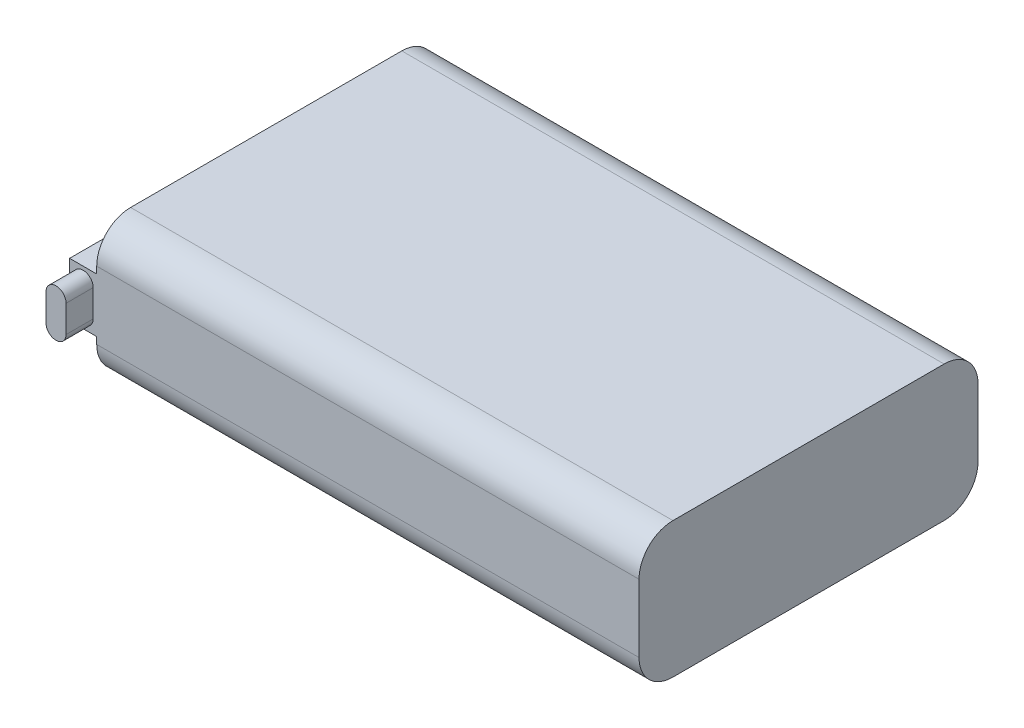
ISO-10303-21;
HEADER;
FILE_DESCRIPTION(('STEP AP214'),'2;1');
FILE_NAME('part.step','',(''),(''),'','','');
FILE_SCHEMA(('AUTOMOTIVE_DESIGN { 1 0 10303 214 1 1 1 1 }'));
ENDSEC;
DATA;
#1=APPLICATION_CONTEXT('core data for automotive mechanical design processes');
#2=APPLICATION_PROTOCOL_DEFINITION('international standard','automotive_design',2000,#1);
#3=PRODUCT_CONTEXT('',#1,'mechanical');
#4=PRODUCT('Part','Part','',(#3));
#5=PRODUCT_RELATED_PRODUCT_CATEGORY('part','',(#4));
#6=PRODUCT_DEFINITION_FORMATION('','',#4);
#7=PRODUCT_DEFINITION_CONTEXT('part definition',#1,'design');
#8=PRODUCT_DEFINITION('design','',#6,#7);
#9=PRODUCT_DEFINITION_SHAPE('','',#8);
#10=(LENGTH_UNIT() NAMED_UNIT(*) SI_UNIT(.MILLI.,.METRE.));
#11=(NAMED_UNIT(*) PLANE_ANGLE_UNIT() SI_UNIT($,.RADIAN.));
#12=(NAMED_UNIT(*) SI_UNIT($,.STERADIAN.) SOLID_ANGLE_UNIT());
#13=UNCERTAINTY_MEASURE_WITH_UNIT(LENGTH_MEASURE(1.E-05),#10,'distance_accuracy_value','');
#14=(GEOMETRIC_REPRESENTATION_CONTEXT(3) GLOBAL_UNCERTAINTY_ASSIGNED_CONTEXT((#13)) GLOBAL_UNIT_ASSIGNED_CONTEXT((#10,
#11,#12)) REPRESENTATION_CONTEXT('',''));
#15=CARTESIAN_POINT('',(0.,0.,0.));
#16=DIRECTION('',(0.,0.,1.));
#17=DIRECTION('',(1.,0.,0.));
#18=AXIS2_PLACEMENT_3D('',#15,#16,#17);
#19=CARTESIAN_POINT('',(0.,10.,0.));
#20=DIRECTION('',(0.,0.,-1.));
#21=DIRECTION('',(-1.,0.,0.));
#22=AXIS2_PLACEMENT_3D('',#19,#20,#21);
#23=PLANE('',#22);
#24=DIRECTION('',(0.,-1.,0.));
#25=VECTOR('',#24,1.);
#26=CARTESIAN_POINT('',(40.,10.,0.));
#27=LINE('',#26,#25);
#28=CARTESIAN_POINT('',(40.,7.5,0.));
#29=VERTEX_POINT('',#28);
#30=CARTESIAN_POINT('',(40.,2.5,0.));
#31=VERTEX_POINT('',#30);
#32=EDGE_CURVE('E222',#29,#31,#27,.T.);
#33=ORIENTED_EDGE('',*,*,#32,.F.);
#34=DIRECTION('',(1.,0.,0.));
#35=VECTOR('',#34,1.);
#36=CARTESIAN_POINT('',(0.,7.5,0.));
#37=LINE('',#36,#35);
#38=CARTESIAN_POINT('',(0.,7.5,0.));
#39=VERTEX_POINT('',#38);
#40=EDGE_CURVE('E246',#29,#39,#37,.F.);
#41=ORIENTED_EDGE('',*,*,#40,.T.);
#42=DIRECTION('',(0.,-1.,0.));
#43=VECTOR('',#42,1.);
#44=CARTESIAN_POINT('',(0.,10.,0.));
#45=LINE('',#44,#43);
#46=CARTESIAN_POINT('',(0.,7.,0.));
#47=VERTEX_POINT('',#46);
#48=EDGE_CURVE('E226',#39,#47,#45,.T.);
#49=ORIENTED_EDGE('',*,*,#48,.T.);
#50=DIRECTION('',(1.,0.,0.));
#51=VECTOR('',#50,1.);
#52=CARTESIAN_POINT('',(-2.,7.,0.));
#53=LINE('',#52,#51);
#54=CARTESIAN_POINT('',(-2.,7.,0.));
#55=VERTEX_POINT('',#54);
#56=EDGE_CURVE('E195',#55,#47,#53,.T.);
#57=ORIENTED_EDGE('',*,*,#56,.F.);
#58=DIRECTION('',(0.,1.,0.));
#59=VECTOR('',#58,1.);
#60=CARTESIAN_POINT('',(-2.,7.,0.));
#61=LINE('',#60,#59);
#62=CARTESIAN_POINT('',(-2.,3.,0.));
#63=VERTEX_POINT('',#62);
#64=EDGE_CURVE('E186',#63,#55,#61,.T.);
#65=ORIENTED_EDGE('',*,*,#64,.F.);
#66=DIRECTION('',(1.,0.,0.));
#67=VECTOR('',#66,1.);
#68=CARTESIAN_POINT('',(-2.,3.,0.));
#69=LINE('',#68,#67);
#70=CARTESIAN_POINT('',(0.,3.,0.));
#71=VERTEX_POINT('',#70);
#72=EDGE_CURVE('E198',#63,#71,#69,.T.);
#73=ORIENTED_EDGE('',*,*,#72,.T.);
#74=CARTESIAN_POINT('',(0.,2.5,0.));
#75=VERTEX_POINT('',#74);
#76=EDGE_CURVE('E225',#71,#75,#45,.T.);
#77=ORIENTED_EDGE('',*,*,#76,.T.);
#78=DIRECTION('',(1.,0.,0.));
#79=VECTOR('',#78,1.);
#80=CARTESIAN_POINT('',(40.,2.5,0.));
#81=LINE('',#80,#79);
#82=EDGE_CURVE('E243',#75,#31,#81,.T.);
#83=ORIENTED_EDGE('',*,*,#82,.T.);
#84=EDGE_LOOP('',(#33,#41,#49,#57,#65,#73,#77,#83));
#85=FACE_BOUND('',#84,.T.);
#86=CARTESIAN_POINT('',(-1.,6.,0.));
#87=DIRECTION('',(0.,0.,1.));
#88=DIRECTION('',(1.,0.,0.));
#89=AXIS2_PLACEMENT_3D('',#86,#87,#88);
#90=CIRCLE('',#89,0.74);
#91=CARTESIAN_POINT('',(-0.260000000000002,6.,0.));
#92=VERTEX_POINT('',#91);
#93=CARTESIAN_POINT('',(-1.74,6.,0.));
#94=VERTEX_POINT('',#93);
#95=EDGE_CURVE('E171',#92,#94,#90,.T.);
#96=ORIENTED_EDGE('',*,*,#95,.F.);
#97=DIRECTION('',(0.,1.,0.));
#98=VECTOR('',#97,1.);
#99=CARTESIAN_POINT('',(-0.260000000000002,6.,0.));
#100=LINE('',#99,#98);
#101=CARTESIAN_POINT('',(-0.260000000000001,4.,0.));
#102=VERTEX_POINT('',#101);
#103=EDGE_CURVE('E168',#102,#92,#100,.T.);
#104=ORIENTED_EDGE('',*,*,#103,.F.);
#105=CARTESIAN_POINT('',(-1.,4.,0.));
#106=DIRECTION('',(0.,0.,1.));
#107=DIRECTION('',(1.,0.,0.));
#108=AXIS2_PLACEMENT_3D('',#105,#106,#107);
#109=CIRCLE('',#108,0.74);
#110=CARTESIAN_POINT('',(-1.74,4.,0.));
#111=VERTEX_POINT('',#110);
#112=EDGE_CURVE('E59',#111,#102,#109,.T.);
#113=ORIENTED_EDGE('',*,*,#112,.F.);
#114=DIRECTION('',(0.,-1.,0.));
#115=VECTOR('',#114,1.);
#116=CARTESIAN_POINT('',(-1.74,6.,0.));
#117=LINE('',#116,#115);
#118=EDGE_CURVE('E54',#94,#111,#117,.T.);
#119=ORIENTED_EDGE('',*,*,#118,.F.);
#120=EDGE_LOOP('',(#96,#104,#113,#119));
#121=FACE_BOUND('',#120,.T.);
#122=ADVANCED_FACE('F39',(#85,#121),#23,.F.);
#123=CARTESIAN_POINT('',(0.,10.,0.));
#124=DIRECTION('',(1.,0.,0.));
#125=DIRECTION('',(0.,0.,-1.));
#126=AXIS2_PLACEMENT_3D('',#123,#124,#125);
#127=PLANE('',#126);
#128=DIRECTION('',(0.,0.,-1.));
#129=VECTOR('',#128,1.);
#130=CARTESIAN_POINT('',(0.,7.,-25.));
#131=LINE('',#130,#129);
#132=CARTESIAN_POINT('',(0.,7.,-25.));
#133=VERTEX_POINT('',#132);
#134=EDGE_CURVE('E175',#47,#133,#131,.T.);
#135=ORIENTED_EDGE('',*,*,#134,.F.);
#136=ORIENTED_EDGE('',*,*,#48,.F.);
#137=CARTESIAN_POINT('',(0.,7.5,-2.5));
#138=DIRECTION('',(1.,0.,0.));
#139=DIRECTION('',(0.,0.,-1.));
#140=AXIS2_PLACEMENT_3D('',#137,#138,#139);
#141=CIRCLE('',#140,2.5);
#142=CARTESIAN_POINT('',(0.,10.,-2.5));
#143=VERTEX_POINT('',#142);
#144=EDGE_CURVE('E255',#39,#143,#141,.F.);
#145=ORIENTED_EDGE('',*,*,#144,.T.);
#146=DIRECTION('',(0.,0.,1.));
#147=VECTOR('',#146,1.);
#148=CARTESIAN_POINT('',(0.,10.,0.));
#149=LINE('',#148,#147);
#150=CARTESIAN_POINT('',(0.,10.,-22.5));
#151=VERTEX_POINT('',#150);
#152=EDGE_CURVE('E205',#151,#143,#149,.T.);
#153=ORIENTED_EDGE('',*,*,#152,.F.);
#154=CARTESIAN_POINT('',(0.,7.5,-22.5));
#155=DIRECTION('',(1.,0.,0.));
#156=DIRECTION('',(0.,0.,-1.));
#157=AXIS2_PLACEMENT_3D('',#154,#155,#156);
#158=CIRCLE('',#157,2.5);
#159=CARTESIAN_POINT('',(0.,7.5,-25.));
#160=VERTEX_POINT('',#159);
#161=EDGE_CURVE('E253',#151,#160,#158,.F.);
#162=ORIENTED_EDGE('',*,*,#161,.T.);
#163=DIRECTION('',(0.,-1.,0.));
#164=VECTOR('',#163,1.);
#165=CARTESIAN_POINT('',(0.,10.,-25.));
#166=LINE('',#165,#164);
#167=EDGE_CURVE('E217',#160,#133,#166,.T.);
#168=ORIENTED_EDGE('',*,*,#167,.T.);
#169=EDGE_LOOP('',(#135,#136,#145,#153,#162,#168));
#170=FACE_BOUND('',#169,.T.);
#171=ADVANCED_FACE('F288',(#170),#127,.F.);
#172=DIRECTION('',(0.,0.,1.));
#173=VECTOR('',#172,1.);
#174=CARTESIAN_POINT('',(0.,3.,-25.));
#175=LINE('',#174,#173);
#176=CARTESIAN_POINT('',(0.,3.,-25.));
#177=VERTEX_POINT('',#176);
#178=EDGE_CURVE('E172',#177,#71,#175,.T.);
#179=ORIENTED_EDGE('',*,*,#178,.F.);
#180=CARTESIAN_POINT('',(0.,2.5,-25.));
#181=VERTEX_POINT('',#180);
#182=EDGE_CURVE('E212',#177,#181,#166,.T.);
#183=ORIENTED_EDGE('',*,*,#182,.T.);
#184=CARTESIAN_POINT('',(0.,2.5,-22.5));
#185=DIRECTION('',(1.,0.,0.));
#186=DIRECTION('',(0.,0.,-1.));
#187=AXIS2_PLACEMENT_3D('',#184,#185,#186);
#188=CIRCLE('',#187,2.5);
#189=CARTESIAN_POINT('',(0.,0.,-22.5));
#190=VERTEX_POINT('',#189);
#191=EDGE_CURVE('E251',#181,#190,#188,.F.);
#192=ORIENTED_EDGE('',*,*,#191,.T.);
#193=DIRECTION('',(0.,0.,1.));
#194=VECTOR('',#193,1.);
#195=CARTESIAN_POINT('',(0.,0.,0.));
#196=LINE('',#195,#194);
#197=CARTESIAN_POINT('',(0.,0.,-2.5));
#198=VERTEX_POINT('',#197);
#199=EDGE_CURVE('E204',#190,#198,#196,.T.);
#200=ORIENTED_EDGE('',*,*,#199,.T.);
#201=CARTESIAN_POINT('',(0.,2.5,-2.5));
#202=DIRECTION('',(1.,0.,0.));
#203=DIRECTION('',(0.,0.,-1.));
#204=AXIS2_PLACEMENT_3D('',#201,#202,#203);
#205=CIRCLE('',#204,2.5);
#206=EDGE_CURVE('E248',#198,#75,#205,.F.);
#207=ORIENTED_EDGE('',*,*,#206,.T.);
#208=ORIENTED_EDGE('',*,*,#76,.F.);
#209=EDGE_LOOP('',(#179,#183,#192,#200,#207,#208));
#210=FACE_BOUND('',#209,.T.);
#211=ADVANCED_FACE('F270',(#210),#127,.F.);
#212=CARTESIAN_POINT('',(40.,10.,0.));
#213=DIRECTION('',(-1.,0.,0.));
#214=DIRECTION('',(0.,0.,1.));
#215=AXIS2_PLACEMENT_3D('',#212,#213,#214);
#216=PLANE('',#215);
#217=DIRECTION('',(0.,0.,-1.));
#218=VECTOR('',#217,1.);
#219=CARTESIAN_POINT('',(40.,10.,0.));
#220=LINE('',#219,#218);
#221=CARTESIAN_POINT('',(40.,10.,-2.5));
#222=VERTEX_POINT('',#221);
#223=CARTESIAN_POINT('',(40.,10.,-22.5));
#224=VERTEX_POINT('',#223);
#225=EDGE_CURVE('E208',#222,#224,#220,.T.);
#226=ORIENTED_EDGE('',*,*,#225,.F.);
#227=CARTESIAN_POINT('',(40.,7.5,-2.5));
#228=DIRECTION('',(-1.,0.,0.));
#229=DIRECTION('',(0.,0.,1.));
#230=AXIS2_PLACEMENT_3D('',#227,#228,#229);
#231=CIRCLE('',#230,2.5);
#232=EDGE_CURVE('E241',#222,#29,#231,.F.);
#233=ORIENTED_EDGE('',*,*,#232,.T.);
#234=ORIENTED_EDGE('',*,*,#32,.T.);
#235=CARTESIAN_POINT('',(40.,2.5,-2.5));
#236=DIRECTION('',(-1.,0.,0.));
#237=DIRECTION('',(0.,0.,1.));
#238=AXIS2_PLACEMENT_3D('',#235,#236,#237);
#239=CIRCLE('',#238,2.5);
#240=CARTESIAN_POINT('',(40.,0.,-2.5));
#241=VERTEX_POINT('',#240);
#242=EDGE_CURVE('E235',#31,#241,#239,.F.);
#243=ORIENTED_EDGE('',*,*,#242,.T.);
#244=DIRECTION('',(0.,0.,-1.));
#245=VECTOR('',#244,1.);
#246=CARTESIAN_POINT('',(40.,0.,0.));
#247=LINE('',#246,#245);
#248=CARTESIAN_POINT('',(40.,0.,-22.5));
#249=VERTEX_POINT('',#248);
#250=EDGE_CURVE('E209',#241,#249,#247,.T.);
#251=ORIENTED_EDGE('',*,*,#250,.T.);
#252=CARTESIAN_POINT('',(40.,2.5,-22.5));
#253=DIRECTION('',(-1.,0.,0.));
#254=DIRECTION('',(0.,0.,1.));
#255=AXIS2_PLACEMENT_3D('',#252,#253,#254);
#256=CIRCLE('',#255,2.5);
#257=CARTESIAN_POINT('',(40.,2.5,-25.));
#258=VERTEX_POINT('',#257);
#259=EDGE_CURVE('E237',#249,#258,#256,.F.);
#260=ORIENTED_EDGE('',*,*,#259,.T.);
#261=DIRECTION('',(0.,-1.,0.));
#262=VECTOR('',#261,1.);
#263=CARTESIAN_POINT('',(40.,10.,-25.));
#264=LINE('',#263,#262);
#265=CARTESIAN_POINT('',(40.,7.5,-25.));
#266=VERTEX_POINT('',#265);
#267=EDGE_CURVE('E219',#266,#258,#264,.T.);
#268=ORIENTED_EDGE('',*,*,#267,.F.);
#269=CARTESIAN_POINT('',(40.,7.5,-22.5));
#270=DIRECTION('',(-1.,0.,0.));
#271=DIRECTION('',(0.,0.,1.));
#272=AXIS2_PLACEMENT_3D('',#269,#270,#271);
#273=CIRCLE('',#272,2.5);
#274=EDGE_CURVE('E239',#266,#224,#273,.F.);
#275=ORIENTED_EDGE('',*,*,#274,.T.);
#276=EDGE_LOOP('',(#226,#233,#234,#243,#251,#260,#268,#275));
#277=FACE_BOUND('',#276,.T.);
#278=ADVANCED_FACE('F278',(#277),#216,.F.);
#279=CARTESIAN_POINT('',(0.,10.,-25.));
#280=DIRECTION('',(0.,0.,1.));
#281=DIRECTION('',(1.,0.,0.));
#282=AXIS2_PLACEMENT_3D('',#279,#280,#281);
#283=PLANE('',#282);
#284=ORIENTED_EDGE('',*,*,#167,.F.);
#285=DIRECTION('',(-1.,0.,0.));
#286=VECTOR('',#285,1.);
#287=CARTESIAN_POINT('',(0.,7.5,-25.));
#288=LINE('',#287,#286);
#289=EDGE_CURVE('E260',#160,#266,#288,.F.);
#290=ORIENTED_EDGE('',*,*,#289,.T.);
#291=ORIENTED_EDGE('',*,*,#267,.T.);
#292=DIRECTION('',(-1.,0.,0.));
#293=VECTOR('',#292,1.);
#294=CARTESIAN_POINT('',(0.,2.5,-25.));
#295=LINE('',#294,#293);
#296=EDGE_CURVE('E257',#258,#181,#295,.T.);
#297=ORIENTED_EDGE('',*,*,#296,.T.);
#298=ORIENTED_EDGE('',*,*,#182,.F.);
#299=DIRECTION('',(1.,0.,0.));
#300=VECTOR('',#299,1.);
#301=CARTESIAN_POINT('',(-2.,3.,-25.));
#302=LINE('',#301,#300);
#303=CARTESIAN_POINT('',(-2.,3.,-25.));
#304=VERTEX_POINT('',#303);
#305=EDGE_CURVE('E201',#304,#177,#302,.T.);
#306=ORIENTED_EDGE('',*,*,#305,.F.);
#307=DIRECTION('',(0.,-1.,0.));
#308=VECTOR('',#307,1.);
#309=CARTESIAN_POINT('',(-2.,7.,-25.));
#310=LINE('',#309,#308);
#311=CARTESIAN_POINT('',(-2.,7.,-25.));
#312=VERTEX_POINT('',#311);
#313=EDGE_CURVE('E181',#312,#304,#310,.T.);
#314=ORIENTED_EDGE('',*,*,#313,.F.);
#315=DIRECTION('',(1.,0.,0.));
#316=VECTOR('',#315,1.);
#317=CARTESIAN_POINT('',(-2.,7.,-25.));
#318=LINE('',#317,#316);
#319=EDGE_CURVE('E189',#312,#133,#318,.T.);
#320=ORIENTED_EDGE('',*,*,#319,.T.);
#321=EDGE_LOOP('',(#284,#290,#291,#297,#298,#306,#314,#320));
#322=FACE_BOUND('',#321,.T.);
#323=ADVANCED_FACE('F306',(#322),#283,.F.);
#324=CARTESIAN_POINT('',(0.,10.,0.));
#325=DIRECTION('',(0.,-1.,0.));
#326=DIRECTION('',(0.,0.,-1.));
#327=AXIS2_PLACEMENT_3D('',#324,#325,#326);
#328=PLANE('',#327);
#329=ORIENTED_EDGE('',*,*,#152,.T.);
#330=DIRECTION('',(1.,0.,0.));
#331=VECTOR('',#330,1.);
#332=CARTESIAN_POINT('',(0.,10.,-2.5));
#333=LINE('',#332,#331);
#334=EDGE_CURVE('E232',#143,#222,#333,.T.);
#335=ORIENTED_EDGE('',*,*,#334,.T.);
#336=ORIENTED_EDGE('',*,*,#225,.T.);
#337=DIRECTION('',(-1.,0.,0.));
#338=VECTOR('',#337,1.);
#339=CARTESIAN_POINT('',(0.,10.,-22.5));
#340=LINE('',#339,#338);
#341=EDGE_CURVE('E229',#224,#151,#340,.T.);
#342=ORIENTED_EDGE('',*,*,#341,.T.);
#343=EDGE_LOOP('',(#329,#335,#336,#342));
#344=FACE_BOUND('',#343,.T.);
#345=ADVANCED_FACE('F284',(#344),#328,.F.);
#346=CARTESIAN_POINT('',(0.,0.,0.));
#347=DIRECTION('',(0.,-1.,0.));
#348=DIRECTION('',(0.,0.,-1.));
#349=AXIS2_PLACEMENT_3D('',#346,#347,#348);
#350=PLANE('',#349);
#351=ORIENTED_EDGE('',*,*,#199,.F.);
#352=DIRECTION('',(-1.,0.,0.));
#353=VECTOR('',#352,1.);
#354=CARTESIAN_POINT('',(40.,0.,-22.5));
#355=LINE('',#354,#353);
#356=EDGE_CURVE('E11',#190,#249,#355,.F.);
#357=ORIENTED_EDGE('',*,*,#356,.T.);
#358=ORIENTED_EDGE('',*,*,#250,.F.);
#359=DIRECTION('',(1.,0.,0.));
#360=VECTOR('',#359,1.);
#361=CARTESIAN_POINT('',(0.,0.,-2.5));
#362=LINE('',#361,#360);
#363=EDGE_CURVE('E47',#241,#198,#362,.F.);
#364=ORIENTED_EDGE('',*,*,#363,.T.);
#365=EDGE_LOOP('',(#351,#357,#358,#364));
#366=FACE_BOUND('',#365,.T.);
#367=ADVANCED_FACE('F265',(#366),#350,.T.);
#368=CARTESIAN_POINT('',(0.,7.5,-2.5));
#369=DIRECTION('',(1.,0.,0.));
#370=DIRECTION('',(0.,0.,-1.));
#371=AXIS2_PLACEMENT_3D('',#368,#369,#370);
#372=CYLINDRICAL_SURFACE('',#371,2.5);
#373=ORIENTED_EDGE('',*,*,#144,.F.);
#374=ORIENTED_EDGE('',*,*,#40,.F.);
#375=ORIENTED_EDGE('',*,*,#232,.F.);
#376=ORIENTED_EDGE('',*,*,#334,.F.);
#377=EDGE_LOOP('',(#373,#374,#375,#376));
#378=FACE_BOUND('',#377,.T.);
#379=ADVANCED_FACE('F282',(#378),#372,.T.);
#380=CARTESIAN_POINT('',(0.,7.5,-22.5));
#381=DIRECTION('',(-1.,0.,0.));
#382=DIRECTION('',(0.,0.,1.));
#383=AXIS2_PLACEMENT_3D('',#380,#381,#382);
#384=CYLINDRICAL_SURFACE('',#383,2.5);
#385=ORIENTED_EDGE('',*,*,#274,.F.);
#386=ORIENTED_EDGE('',*,*,#289,.F.);
#387=ORIENTED_EDGE('',*,*,#161,.F.);
#388=ORIENTED_EDGE('',*,*,#341,.F.);
#389=EDGE_LOOP('',(#385,#386,#387,#388));
#390=FACE_BOUND('',#389,.T.);
#391=ADVANCED_FACE('F315',(#390),#384,.T.);
#392=CARTESIAN_POINT('',(0.,2.5,-22.5));
#393=DIRECTION('',(1.,0.,0.));
#394=DIRECTION('',(0.,0.,-1.));
#395=AXIS2_PLACEMENT_3D('',#392,#393,#394);
#396=CYLINDRICAL_SURFACE('',#395,2.5);
#397=ORIENTED_EDGE('',*,*,#259,.F.);
#398=ORIENTED_EDGE('',*,*,#356,.F.);
#399=ORIENTED_EDGE('',*,*,#191,.F.);
#400=ORIENTED_EDGE('',*,*,#296,.F.);
#401=EDGE_LOOP('',(#397,#398,#399,#400));
#402=FACE_BOUND('',#401,.T.);
#403=ADVANCED_FACE('F311',(#402),#396,.T.);
#404=CARTESIAN_POINT('',(0.,2.5,-2.5));
#405=DIRECTION('',(-1.,0.,0.));
#406=DIRECTION('',(0.,0.,1.));
#407=AXIS2_PLACEMENT_3D('',#404,#405,#406);
#408=CYLINDRICAL_SURFACE('',#407,2.5);
#409=ORIENTED_EDGE('',*,*,#206,.F.);
#410=ORIENTED_EDGE('',*,*,#363,.F.);
#411=ORIENTED_EDGE('',*,*,#242,.F.);
#412=ORIENTED_EDGE('',*,*,#82,.F.);
#413=EDGE_LOOP('',(#409,#410,#411,#412));
#414=FACE_BOUND('',#413,.T.);
#415=ADVANCED_FACE('F41',(#414),#408,.T.);
#416=CARTESIAN_POINT('',(-2.,3.,-25.));
#417=DIRECTION('',(0.,1.,0.));
#418=DIRECTION('',(0.,0.,1.));
#419=AXIS2_PLACEMENT_3D('',#416,#417,#418);
#420=PLANE('',#419);
#421=ORIENTED_EDGE('',*,*,#178,.T.);
#422=ORIENTED_EDGE('',*,*,#72,.F.);
#423=DIRECTION('',(0.,0.,1.));
#424=VECTOR('',#423,1.);
#425=CARTESIAN_POINT('',(-2.,3.,-25.));
#426=LINE('',#425,#424);
#427=EDGE_CURVE('E184',#304,#63,#426,.T.);
#428=ORIENTED_EDGE('',*,*,#427,.F.);
#429=ORIENTED_EDGE('',*,*,#305,.T.);
#430=EDGE_LOOP('',(#421,#422,#428,#429));
#431=FACE_BOUND('',#430,.T.);
#432=ADVANCED_FACE('F303',(#431),#420,.F.);
#433=CARTESIAN_POINT('',(-2.,7.,-25.));
#434=DIRECTION('',(0.,-1.,0.));
#435=DIRECTION('',(0.,0.,-1.));
#436=AXIS2_PLACEMENT_3D('',#433,#434,#435);
#437=PLANE('',#436);
#438=ORIENTED_EDGE('',*,*,#134,.T.);
#439=ORIENTED_EDGE('',*,*,#319,.F.);
#440=DIRECTION('',(0.,0.,-1.));
#441=VECTOR('',#440,1.);
#442=CARTESIAN_POINT('',(-2.,7.,-25.));
#443=LINE('',#442,#441);
#444=EDGE_CURVE('E188',#55,#312,#443,.T.);
#445=ORIENTED_EDGE('',*,*,#444,.F.);
#446=ORIENTED_EDGE('',*,*,#56,.T.);
#447=EDGE_LOOP('',(#438,#439,#445,#446));
#448=FACE_BOUND('',#447,.T.);
#449=ADVANCED_FACE('F295',(#448),#437,.F.);
#450=CARTESIAN_POINT('',(-2.,0.,0.));
#451=DIRECTION('',(-1.,0.,0.));
#452=DIRECTION('',(0.,0.,1.));
#453=AXIS2_PLACEMENT_3D('',#450,#451,#452);
#454=PLANE('',#453);
#455=ORIENTED_EDGE('',*,*,#313,.T.);
#456=ORIENTED_EDGE('',*,*,#427,.T.);
#457=ORIENTED_EDGE('',*,*,#64,.T.);
#458=ORIENTED_EDGE('',*,*,#444,.T.);
#459=EDGE_LOOP('',(#455,#456,#457,#458));
#460=FACE_BOUND('',#459,.T.);
#461=ADVANCED_FACE('F299',(#460),#454,.T.);
#462=CARTESIAN_POINT('',(-1.,6.,2.));
#463=DIRECTION('',(0.,0.,-1.));
#464=DIRECTION('',(-1.,0.,0.));
#465=AXIS2_PLACEMENT_3D('',#462,#463,#464);
#466=CYLINDRICAL_SURFACE('',#465,0.74);
#467=ORIENTED_EDGE('',*,*,#95,.T.);
#468=DIRECTION('',(0.,0.,-1.));
#469=VECTOR('',#468,1.);
#470=CARTESIAN_POINT('',(-1.74,6.,2.));
#471=LINE('',#470,#469);
#472=CARTESIAN_POINT('',(-1.74,6.,2.));
#473=VERTEX_POINT('',#472);
#474=EDGE_CURVE('E152',#473,#94,#471,.T.);
#475=ORIENTED_EDGE('',*,*,#474,.F.);
#476=CARTESIAN_POINT('',(-1.,6.,2.));
#477=DIRECTION('',(0.,0.,1.));
#478=DIRECTION('',(1.,0.,0.));
#479=AXIS2_PLACEMENT_3D('',#476,#477,#478);
#480=CIRCLE('',#479,0.74);
#481=CARTESIAN_POINT('',(-0.260000000000002,6.,2.));
#482=VERTEX_POINT('',#481);
#483=EDGE_CURVE('E159',#482,#473,#480,.T.);
#484=ORIENTED_EDGE('',*,*,#483,.F.);
#485=DIRECTION('',(0.,0.,-1.));
#486=VECTOR('',#485,1.);
#487=CARTESIAN_POINT('',(-0.260000000000002,6.,2.));
#488=LINE('',#487,#486);
#489=EDGE_CURVE('E515',#482,#92,#488,.T.);
#490=ORIENTED_EDGE('',*,*,#489,.T.);
#491=EDGE_LOOP('',(#467,#475,#484,#490));
#492=FACE_BOUND('',#491,.T.);
#493=ADVANCED_FACE('F170',(#492),#466,.T.);
#494=CARTESIAN_POINT('',(-1.74,6.,2.));
#495=DIRECTION('',(1.,0.,0.));
#496=DIRECTION('',(0.,1.,0.));
#497=AXIS2_PLACEMENT_3D('',#494,#495,#496);
#498=PLANE('',#497);
#499=ORIENTED_EDGE('',*,*,#118,.T.);
#500=DIRECTION('',(0.,0.,-1.));
#501=VECTOR('',#500,1.);
#502=CARTESIAN_POINT('',(-1.74,4.,2.));
#503=LINE('',#502,#501);
#504=CARTESIAN_POINT('',(-1.74,4.,2.));
#505=VERTEX_POINT('',#504);
#506=EDGE_CURVE('E155',#505,#111,#503,.T.);
#507=ORIENTED_EDGE('',*,*,#506,.F.);
#508=DIRECTION('',(0.,-1.,0.));
#509=VECTOR('',#508,1.);
#510=CARTESIAN_POINT('',(-1.74,6.,2.));
#511=LINE('',#510,#509);
#512=EDGE_CURVE('E148',#473,#505,#511,.T.);
#513=ORIENTED_EDGE('',*,*,#512,.F.);
#514=ORIENTED_EDGE('',*,*,#474,.T.);
#515=EDGE_LOOP('',(#499,#507,#513,#514));
#516=FACE_BOUND('',#515,.T.);
#517=ADVANCED_FACE('F150',(#516),#498,.F.);
#518=CARTESIAN_POINT('',(-1.,4.,2.));
#519=DIRECTION('',(0.,0.,-1.));
#520=DIRECTION('',(-1.,0.,0.));
#521=AXIS2_PLACEMENT_3D('',#518,#519,#520);
#522=CYLINDRICAL_SURFACE('',#521,0.74);
#523=ORIENTED_EDGE('',*,*,#112,.T.);
#524=DIRECTION('',(0.,0.,-1.));
#525=VECTOR('',#524,1.);
#526=CARTESIAN_POINT('',(-0.260000000000001,4.,2.));
#527=LINE('',#526,#525);
#528=CARTESIAN_POINT('',(-0.260000000000001,4.,2.));
#529=VERTEX_POINT('',#528);
#530=EDGE_CURVE('E177',#529,#102,#527,.T.);
#531=ORIENTED_EDGE('',*,*,#530,.F.);
#532=CARTESIAN_POINT('',(-1.,4.,2.));
#533=DIRECTION('',(0.,0.,1.));
#534=DIRECTION('',(1.,0.,0.));
#535=AXIS2_PLACEMENT_3D('',#532,#533,#534);
#536=CIRCLE('',#535,0.74);
#537=EDGE_CURVE('E158',#505,#529,#536,.T.);
#538=ORIENTED_EDGE('',*,*,#537,.F.);
#539=ORIENTED_EDGE('',*,*,#506,.T.);
#540=EDGE_LOOP('',(#523,#531,#538,#539));
#541=FACE_BOUND('',#540,.T.);
#542=ADVANCED_FACE('F348',(#541),#522,.T.);
#543=CARTESIAN_POINT('',(-0.260000000000002,6.,2.));
#544=DIRECTION('',(-1.,0.,0.));
#545=DIRECTION('',(0.,-1.,0.));
#546=AXIS2_PLACEMENT_3D('',#543,#544,#545);
#547=PLANE('',#546);
#548=ORIENTED_EDGE('',*,*,#103,.T.);
#549=ORIENTED_EDGE('',*,*,#489,.F.);
#550=DIRECTION('',(0.,1.,0.));
#551=VECTOR('',#550,1.);
#552=CARTESIAN_POINT('',(-0.260000000000002,6.,2.));
#553=LINE('',#552,#551);
#554=EDGE_CURVE('E164',#529,#482,#553,.T.);
#555=ORIENTED_EDGE('',*,*,#554,.F.);
#556=ORIENTED_EDGE('',*,*,#530,.T.);
#557=EDGE_LOOP('',(#548,#549,#555,#556));
#558=FACE_BOUND('',#557,.T.);
#559=ADVANCED_FACE('F351',(#558),#547,.F.);
#560=CARTESIAN_POINT('',(-1.,6.,2.));
#561=DIRECTION('',(0.,0.,1.));
#562=DIRECTION('',(1.,0.,0.));
#563=AXIS2_PLACEMENT_3D('',#560,#561,#562);
#564=PLANE('',#563);
#565=ORIENTED_EDGE('',*,*,#483,.T.);
#566=ORIENTED_EDGE('',*,*,#512,.T.);
#567=ORIENTED_EDGE('',*,*,#537,.T.);
#568=ORIENTED_EDGE('',*,*,#554,.T.);
#569=EDGE_LOOP('',(#565,#566,#567,#568));
#570=FACE_BOUND('',#569,.T.);
#571=ADVANCED_FACE('F162',(#570),#564,.T.);
#572=CLOSED_SHELL('',(#122,#171,#211,#278,#323,#345,#367,#379,#391,#403,#415,#432,#449,#461,
#493,#517,#542,#559,#571));
#573=MANIFOLD_SOLID_BREP('B2',#572);
#574=ADVANCED_BREP_SHAPE_REPRESENTATION('',(#18,#573),#14);
#575=SHAPE_DEFINITION_REPRESENTATION(#9,#574);
ENDSEC;
END-ISO-10303-21;
